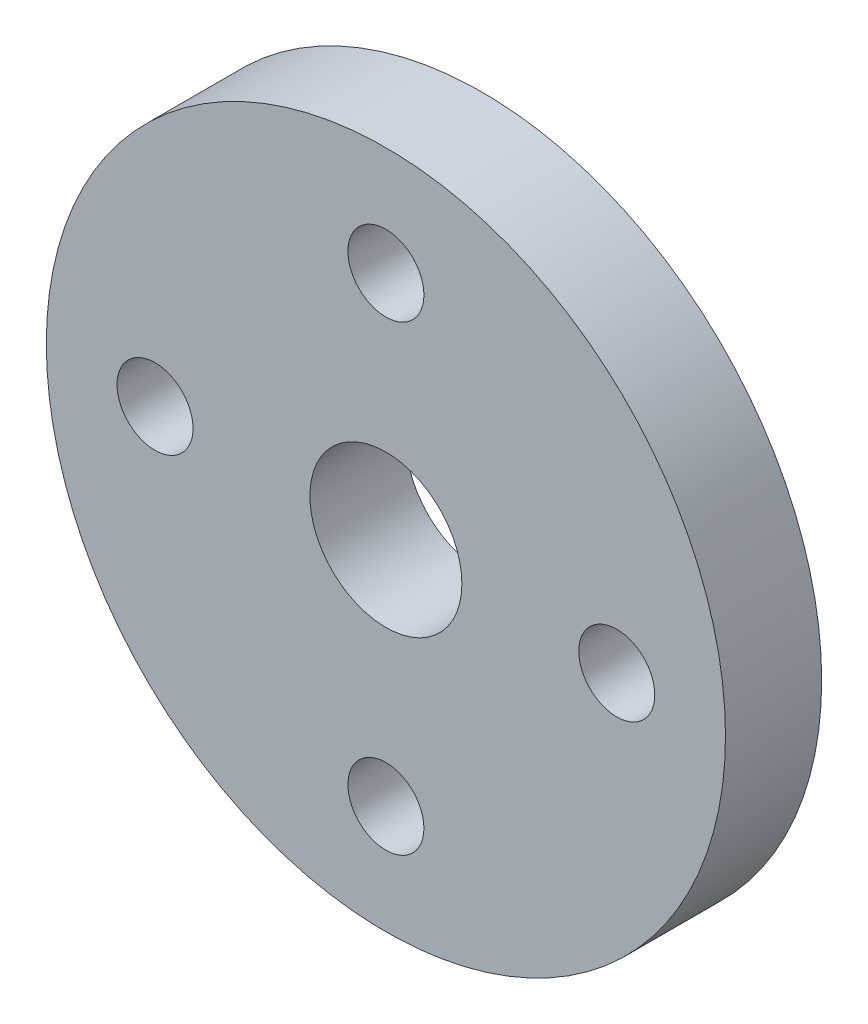
ISO-10303-21;
HEADER;
FILE_DESCRIPTION(('STEP AP214'),'2;1');
FILE_NAME('part.step','',(''),(''),'','','');
FILE_SCHEMA(('AUTOMOTIVE_DESIGN { 1 0 10303 214 1 1 1 1 }'));
ENDSEC;
DATA;
#1=APPLICATION_CONTEXT('core data for automotive mechanical design processes');
#2=APPLICATION_PROTOCOL_DEFINITION('international standard','automotive_design',2000,#1);
#3=PRODUCT_CONTEXT('',#1,'mechanical');
#4=PRODUCT('Part','Part','',(#3));
#5=PRODUCT_RELATED_PRODUCT_CATEGORY('part','',(#4));
#6=PRODUCT_DEFINITION_FORMATION('','',#4);
#7=PRODUCT_DEFINITION_CONTEXT('part definition',#1,'design');
#8=PRODUCT_DEFINITION('design','',#6,#7);
#9=PRODUCT_DEFINITION_SHAPE('','',#8);
#10=(LENGTH_UNIT() NAMED_UNIT(*) SI_UNIT(.MILLI.,.METRE.));
#11=(NAMED_UNIT(*) PLANE_ANGLE_UNIT() SI_UNIT($,.RADIAN.));
#12=(NAMED_UNIT(*) SI_UNIT($,.STERADIAN.) SOLID_ANGLE_UNIT());
#13=UNCERTAINTY_MEASURE_WITH_UNIT(LENGTH_MEASURE(1.E-05),#10,'distance_accuracy_value','');
#14=(GEOMETRIC_REPRESENTATION_CONTEXT(3) GLOBAL_UNCERTAINTY_ASSIGNED_CONTEXT((#13)) GLOBAL_UNIT_ASSIGNED_CONTEXT((#10,
#11,#12)) REPRESENTATION_CONTEXT('',''));
#15=CARTESIAN_POINT('',(0.,0.,0.));
#16=DIRECTION('',(0.,0.,1.));
#17=DIRECTION('',(1.,0.,0.));
#18=AXIS2_PLACEMENT_3D('',#15,#16,#17);
#19=CARTESIAN_POINT('',(0.,0.,5.));
#20=DIRECTION('',(0.,0.,1.));
#21=DIRECTION('',(1.,0.,0.));
#22=AXIS2_PLACEMENT_3D('',#19,#20,#21);
#23=PLANE('',#22);
#24=CARTESIAN_POINT('',(0.,-12.,5.));
#25=DIRECTION('',(0.,0.,1.));
#26=DIRECTION('',(1.,0.,0.));
#27=AXIS2_PLACEMENT_3D('',#24,#25,#26);
#28=CIRCLE('',#27,1.97500000000008);
#29=CARTESIAN_POINT('',(1.97500000000008,-12.,5.));
#30=VERTEX_POINT('',#29);
#31=EDGE_CURVE('E59',#30,#30,#28,.T.);
#32=ORIENTED_EDGE('',*,*,#31,.F.);
#33=EDGE_LOOP('',(#32));
#34=FACE_BOUND('',#33,.T.);
#35=CARTESIAN_POINT('',(0.,12.,5.));
#36=DIRECTION('',(0.,0.,1.));
#37=DIRECTION('',(1.,0.,0.));
#38=AXIS2_PLACEMENT_3D('',#35,#36,#37);
#39=CIRCLE('',#38,1.975);
#40=CARTESIAN_POINT('',(1.975,12.,5.));
#41=VERTEX_POINT('',#40);
#42=EDGE_CURVE('E47',#41,#41,#39,.T.);
#43=ORIENTED_EDGE('',*,*,#42,.F.);
#44=EDGE_LOOP('',(#43));
#45=FACE_BOUND('',#44,.T.);
#46=CARTESIAN_POINT('',(0.,0.,5.));
#47=DIRECTION('',(0.,0.,1.));
#48=DIRECTION('',(1.,0.,0.));
#49=AXIS2_PLACEMENT_3D('',#46,#47,#48);
#50=CIRCLE('',#49,17.65);
#51=CARTESIAN_POINT('',(17.65,0.,5.));
#52=VERTEX_POINT('',#51);
#53=EDGE_CURVE('E10',#52,#52,#50,.T.);
#54=ORIENTED_EDGE('',*,*,#53,.T.);
#55=EDGE_LOOP('',(#54));
#56=FACE_BOUND('',#55,.T.);
#57=CARTESIAN_POINT('',(0.,0.,5.));
#58=DIRECTION('',(0.,0.,1.));
#59=DIRECTION('',(1.,0.,0.));
#60=AXIS2_PLACEMENT_3D('',#57,#58,#59);
#61=CIRCLE('',#60,3.95);
#62=CARTESIAN_POINT('',(3.95,0.,5.));
#63=VERTEX_POINT('',#62);
#64=EDGE_CURVE('E42',#63,#63,#61,.T.);
#65=ORIENTED_EDGE('',*,*,#64,.F.);
#66=EDGE_LOOP('',(#65));
#67=FACE_BOUND('',#66,.T.);
#68=CARTESIAN_POINT('',(12.,0.,5.));
#69=DIRECTION('',(0.,0.,1.));
#70=DIRECTION('',(1.,0.,0.));
#71=AXIS2_PLACEMENT_3D('',#68,#69,#70);
#72=CIRCLE('',#71,1.97500000000004);
#73=CARTESIAN_POINT('',(13.975,0.,5.));
#74=VERTEX_POINT('',#73);
#75=EDGE_CURVE('E53',#74,#74,#72,.T.);
#76=ORIENTED_EDGE('',*,*,#75,.F.);
#77=EDGE_LOOP('',(#76));
#78=FACE_BOUND('',#77,.T.);
#79=CARTESIAN_POINT('',(-12.,0.,5.));
#80=DIRECTION('',(0.,0.,1.));
#81=DIRECTION('',(1.,0.,0.));
#82=AXIS2_PLACEMENT_3D('',#79,#80,#81);
#83=CIRCLE('',#82,1.97500000000012);
#84=CARTESIAN_POINT('',(-10.0249999999999,0.,5.));
#85=VERTEX_POINT('',#84);
#86=EDGE_CURVE('E65',#85,#85,#83,.T.);
#87=ORIENTED_EDGE('',*,*,#86,.F.);
#88=EDGE_LOOP('',(#87));
#89=FACE_BOUND('',#88,.T.);
#90=ADVANCED_FACE('F31',(#34,#45,#56,#67,#78,#89),#23,.T.);
#91=CARTESIAN_POINT('',(0.,0.,0.));
#92=DIRECTION('',(0.,0.,1.));
#93=DIRECTION('',(1.,0.,0.));
#94=AXIS2_PLACEMENT_3D('',#91,#92,#93);
#95=PLANE('',#94);
#96=CARTESIAN_POINT('',(0.,0.,0.));
#97=DIRECTION('',(0.,0.,1.));
#98=DIRECTION('',(1.,0.,0.));
#99=AXIS2_PLACEMENT_3D('',#96,#97,#98);
#100=CIRCLE('',#99,17.65);
#101=CARTESIAN_POINT('',(17.65,0.,0.));
#102=VERTEX_POINT('',#101);
#103=EDGE_CURVE('E35',#102,#102,#100,.T.);
#104=ORIENTED_EDGE('',*,*,#103,.F.);
#105=EDGE_LOOP('',(#104));
#106=FACE_BOUND('',#105,.T.);
#107=CARTESIAN_POINT('',(0.,0.,0.));
#108=DIRECTION('',(0.,0.,1.));
#109=DIRECTION('',(1.,0.,0.));
#110=AXIS2_PLACEMENT_3D('',#107,#108,#109);
#111=CIRCLE('',#110,3.95);
#112=CARTESIAN_POINT('',(3.95,0.,0.));
#113=VERTEX_POINT('',#112);
#114=EDGE_CURVE('E44',#113,#113,#111,.T.);
#115=ORIENTED_EDGE('',*,*,#114,.T.);
#116=EDGE_LOOP('',(#115));
#117=FACE_BOUND('',#116,.T.);
#118=CARTESIAN_POINT('',(0.,12.,0.));
#119=DIRECTION('',(0.,0.,1.));
#120=DIRECTION('',(1.,0.,0.));
#121=AXIS2_PLACEMENT_3D('',#118,#119,#120);
#122=CIRCLE('',#121,1.975);
#123=CARTESIAN_POINT('',(1.975,12.,0.));
#124=VERTEX_POINT('',#123);
#125=EDGE_CURVE('E50',#124,#124,#122,.T.);
#126=ORIENTED_EDGE('',*,*,#125,.T.);
#127=EDGE_LOOP('',(#126));
#128=FACE_BOUND('',#127,.T.);
#129=CARTESIAN_POINT('',(12.,0.,0.));
#130=DIRECTION('',(0.,0.,1.));
#131=DIRECTION('',(1.,0.,0.));
#132=AXIS2_PLACEMENT_3D('',#129,#130,#131);
#133=CIRCLE('',#132,1.97500000000004);
#134=CARTESIAN_POINT('',(13.975,0.,0.));
#135=VERTEX_POINT('',#134);
#136=EDGE_CURVE('E56',#135,#135,#133,.T.);
#137=ORIENTED_EDGE('',*,*,#136,.T.);
#138=EDGE_LOOP('',(#137));
#139=FACE_BOUND('',#138,.T.);
#140=CARTESIAN_POINT('',(0.,-12.,0.));
#141=DIRECTION('',(0.,0.,1.));
#142=DIRECTION('',(1.,0.,0.));
#143=AXIS2_PLACEMENT_3D('',#140,#141,#142);
#144=CIRCLE('',#143,1.97500000000008);
#145=CARTESIAN_POINT('',(1.97500000000008,-12.,0.));
#146=VERTEX_POINT('',#145);
#147=EDGE_CURVE('E62',#146,#146,#144,.T.);
#148=ORIENTED_EDGE('',*,*,#147,.T.);
#149=EDGE_LOOP('',(#148));
#150=FACE_BOUND('',#149,.T.);
#151=CARTESIAN_POINT('',(-12.,0.,0.));
#152=DIRECTION('',(0.,0.,1.));
#153=DIRECTION('',(1.,0.,0.));
#154=AXIS2_PLACEMENT_3D('',#151,#152,#153);
#155=CIRCLE('',#154,1.97500000000012);
#156=CARTESIAN_POINT('',(-10.0249999999999,0.,0.));
#157=VERTEX_POINT('',#156);
#158=EDGE_CURVE('E68',#157,#157,#155,.T.);
#159=ORIENTED_EDGE('',*,*,#158,.T.);
#160=EDGE_LOOP('',(#159));
#161=FACE_BOUND('',#160,.T.);
#162=ADVANCED_FACE('F78',(#106,#117,#128,#139,#150,#161),#95,.F.);
#163=CARTESIAN_POINT('',(0.,0.,5.));
#164=DIRECTION('',(0.,0.,-1.));
#165=DIRECTION('',(-1.,0.,0.));
#166=AXIS2_PLACEMENT_3D('',#163,#164,#165);
#167=CYLINDRICAL_SURFACE('',#166,17.65);
#168=ORIENTED_EDGE('',*,*,#53,.F.);
#169=EDGE_LOOP('',(#168));
#170=FACE_BOUND('',#169,.T.);
#171=ORIENTED_EDGE('',*,*,#103,.T.);
#172=EDGE_LOOP('',(#171));
#173=FACE_BOUND('',#172,.T.);
#174=ADVANCED_FACE('F33',(#170,#173),#167,.T.);
#175=CARTESIAN_POINT('',(0.,0.,5.));
#176=DIRECTION('',(0.,0.,-1.));
#177=DIRECTION('',(-1.,0.,0.));
#178=AXIS2_PLACEMENT_3D('',#175,#176,#177);
#179=CYLINDRICAL_SURFACE('',#178,3.95);
#180=ORIENTED_EDGE('',*,*,#64,.T.);
#181=EDGE_LOOP('',(#180));
#182=FACE_BOUND('',#181,.T.);
#183=ORIENTED_EDGE('',*,*,#114,.F.);
#184=EDGE_LOOP('',(#183));
#185=FACE_BOUND('',#184,.T.);
#186=ADVANCED_FACE('F88',(#182,#185),#179,.F.);
#187=CARTESIAN_POINT('',(0.,12.,5.));
#188=DIRECTION('',(0.,0.,-1.));
#189=DIRECTION('',(-1.,0.,0.));
#190=AXIS2_PLACEMENT_3D('',#187,#188,#189);
#191=CYLINDRICAL_SURFACE('',#190,1.975);
#192=ORIENTED_EDGE('',*,*,#42,.T.);
#193=EDGE_LOOP('',(#192));
#194=FACE_BOUND('',#193,.T.);
#195=ORIENTED_EDGE('',*,*,#125,.F.);
#196=EDGE_LOOP('',(#195));
#197=FACE_BOUND('',#196,.T.);
#198=ADVANCED_FACE('F91',(#194,#197),#191,.F.);
#199=CARTESIAN_POINT('',(12.,0.,5.));
#200=DIRECTION('',(0.,0.,-1.));
#201=DIRECTION('',(-1.,0.,0.));
#202=AXIS2_PLACEMENT_3D('',#199,#200,#201);
#203=CYLINDRICAL_SURFACE('',#202,1.97500000000004);
#204=ORIENTED_EDGE('',*,*,#75,.T.);
#205=EDGE_LOOP('',(#204));
#206=FACE_BOUND('',#205,.T.);
#207=ORIENTED_EDGE('',*,*,#136,.F.);
#208=EDGE_LOOP('',(#207));
#209=FACE_BOUND('',#208,.T.);
#210=ADVANCED_FACE('F95',(#206,#209),#203,.F.);
#211=CARTESIAN_POINT('',(0.,-12.,5.));
#212=DIRECTION('',(0.,0.,-1.));
#213=DIRECTION('',(-1.,0.,0.));
#214=AXIS2_PLACEMENT_3D('',#211,#212,#213);
#215=CYLINDRICAL_SURFACE('',#214,1.97500000000008);
#216=ORIENTED_EDGE('',*,*,#31,.T.);
#217=EDGE_LOOP('',(#216));
#218=FACE_BOUND('',#217,.T.);
#219=ORIENTED_EDGE('',*,*,#147,.F.);
#220=EDGE_LOOP('',(#219));
#221=FACE_BOUND('',#220,.T.);
#222=ADVANCED_FACE('F99',(#218,#221),#215,.F.);
#223=CARTESIAN_POINT('',(-12.,0.,5.));
#224=DIRECTION('',(0.,0.,-1.));
#225=DIRECTION('',(-1.,0.,0.));
#226=AXIS2_PLACEMENT_3D('',#223,#224,#225);
#227=CYLINDRICAL_SURFACE('',#226,1.97500000000012);
#228=ORIENTED_EDGE('',*,*,#86,.T.);
#229=EDGE_LOOP('',(#228));
#230=FACE_BOUND('',#229,.T.);
#231=ORIENTED_EDGE('',*,*,#158,.F.);
#232=EDGE_LOOP('',(#231));
#233=FACE_BOUND('',#232,.T.);
#234=ADVANCED_FACE('F74',(#230,#233),#227,.F.);
#235=CLOSED_SHELL('',(#90,#162,#174,#186,#198,#210,#222,#234));
#236=MANIFOLD_SOLID_BREP('B2',#235);
#237=ADVANCED_BREP_SHAPE_REPRESENTATION('',(#18,#236),#14);
#238=SHAPE_DEFINITION_REPRESENTATION(#9,#237);
ENDSEC;
END-ISO-10303-21;
